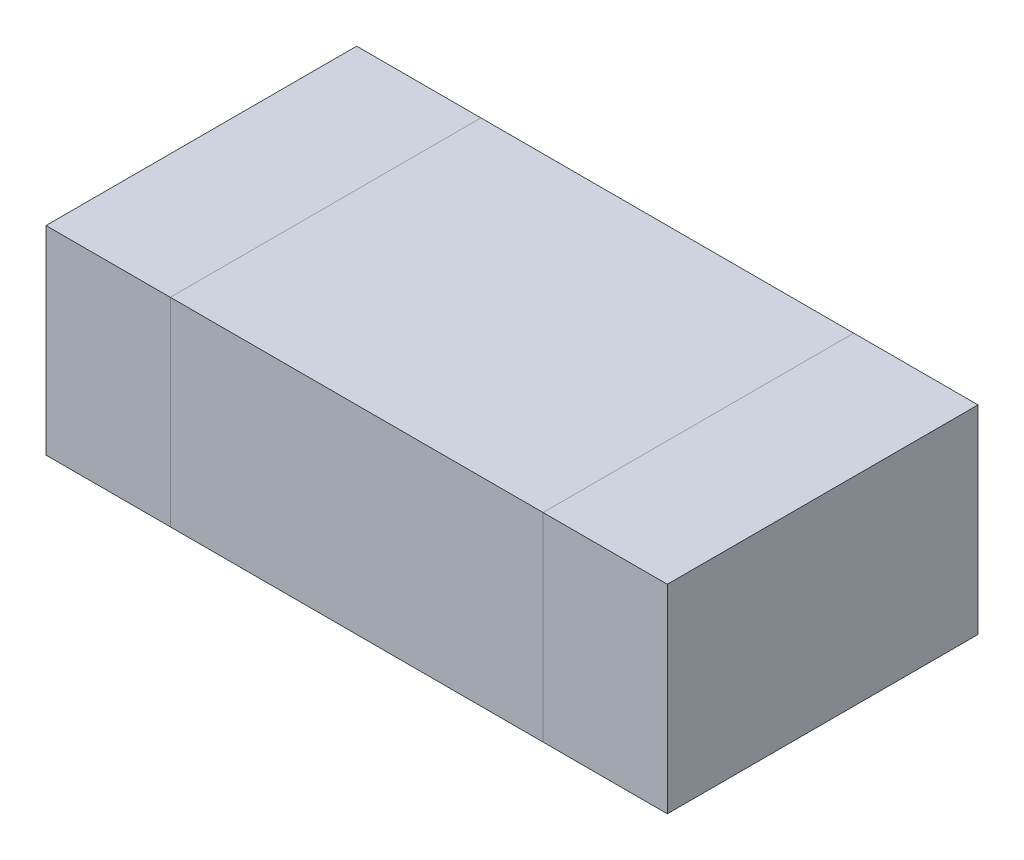
ISO-10303-21;
HEADER;
FILE_DESCRIPTION(('STEP AP214'),'2;1');
FILE_NAME('part.step','',(''),(''),'','','');
FILE_SCHEMA(('AUTOMOTIVE_DESIGN { 1 0 10303 214 1 1 1 1 }'));
ENDSEC;
DATA;
#1=APPLICATION_CONTEXT('core data for automotive mechanical design processes');
#2=APPLICATION_PROTOCOL_DEFINITION('international standard','automotive_design',2000,#1);
#3=PRODUCT_CONTEXT('',#1,'mechanical');
#4=PRODUCT('Part','Part','',(#3));
#5=PRODUCT_RELATED_PRODUCT_CATEGORY('part','',(#4));
#6=PRODUCT_DEFINITION_FORMATION('','',#4);
#7=PRODUCT_DEFINITION_CONTEXT('part definition',#1,'design');
#8=PRODUCT_DEFINITION('design','',#6,#7);
#9=PRODUCT_DEFINITION_SHAPE('','',#8);
#10=(LENGTH_UNIT() NAMED_UNIT(*) SI_UNIT(.MILLI.,.METRE.));
#11=(NAMED_UNIT(*) PLANE_ANGLE_UNIT() SI_UNIT($,.RADIAN.));
#12=(NAMED_UNIT(*) SI_UNIT($,.STERADIAN.) SOLID_ANGLE_UNIT());
#13=UNCERTAINTY_MEASURE_WITH_UNIT(LENGTH_MEASURE(1.E-05),#10,'distance_accuracy_value','');
#14=(GEOMETRIC_REPRESENTATION_CONTEXT(3) GLOBAL_UNCERTAINTY_ASSIGNED_CONTEXT((#13)) GLOBAL_UNIT_ASSIGNED_CONTEXT((#10,
#11,#12)) REPRESENTATION_CONTEXT('',''));
#15=CARTESIAN_POINT('',(0.,0.,0.));
#16=DIRECTION('',(0.,0.,1.));
#17=DIRECTION('',(1.,0.,0.));
#18=AXIS2_PLACEMENT_3D('',#15,#16,#17);
#19=CARTESIAN_POINT('',(-0.5,0.32,0.));
#20=DIRECTION('',(1.,0.,0.));
#21=DIRECTION('',(0.,0.,-1.));
#22=AXIS2_PLACEMENT_3D('',#19,#20,#21);
#23=PLANE('',#22);
#24=DIRECTION('',(0.,1.,0.));
#25=VECTOR('',#24,1.);
#26=CARTESIAN_POINT('',(-0.5,0.32,0.25));
#27=LINE('',#26,#25);
#28=CARTESIAN_POINT('',(-0.5,0.32,0.25));
#29=VERTEX_POINT('',#28);
#30=CARTESIAN_POINT('',(-0.5,0.,0.25));
#31=VERTEX_POINT('',#30);
#32=EDGE_CURVE('P0_E80',#29,#31,#27,.F.);
#33=ORIENTED_EDGE('',*,*,#32,.F.);
#34=DIRECTION('',(0.,0.,1.));
#35=VECTOR('',#34,1.);
#36=CARTESIAN_POINT('',(-0.5,0.32,0.));
#37=LINE('',#36,#35);
#38=CARTESIAN_POINT('',(-0.5,0.32,-0.25));
#39=VERTEX_POINT('',#38);
#40=EDGE_CURVE('P0_E60',#39,#29,#37,.T.);
#41=ORIENTED_EDGE('',*,*,#40,.F.);
#42=DIRECTION('',(0.,1.,0.));
#43=VECTOR('',#42,1.);
#44=CARTESIAN_POINT('',(-0.5,0.32,-0.25));
#45=LINE('',#44,#43);
#46=CARTESIAN_POINT('',(-0.5,0.,-0.25));
#47=VERTEX_POINT('',#46);
#48=EDGE_CURVE('P0_E54',#39,#47,#45,.F.);
#49=ORIENTED_EDGE('',*,*,#48,.T.);
#50=DIRECTION('',(0.,0.,1.));
#51=VECTOR('',#50,1.);
#52=CARTESIAN_POINT('',(-0.5,0.,0.));
#53=LINE('',#52,#51);
#54=EDGE_CURVE('P0_E19',#47,#31,#53,.T.);
#55=ORIENTED_EDGE('',*,*,#54,.T.);
#56=EDGE_LOOP('',(#33,#41,#49,#55));
#57=FACE_BOUND('',#56,.T.);
#58=ADVANCED_FACE('P0_F16',(#57),#23,.F.);
#59=CARTESIAN_POINT('',(0.,0.,0.));
#60=DIRECTION('',(0.,1.,0.));
#61=DIRECTION('',(0.,0.,1.));
#62=AXIS2_PLACEMENT_3D('',#59,#60,#61);
#63=PLANE('',#62);
#64=DIRECTION('',(0.,0.,-1.));
#65=VECTOR('',#64,1.);
#66=CARTESIAN_POINT('',(-0.3,0.,0.));
#67=LINE('',#66,#65);
#68=CARTESIAN_POINT('',(-0.3,0.,0.25));
#69=VERTEX_POINT('',#68);
#70=CARTESIAN_POINT('',(-0.3,0.,-0.25));
#71=VERTEX_POINT('',#70);
#72=EDGE_CURVE('P0_E82',#69,#71,#67,.T.);
#73=ORIENTED_EDGE('',*,*,#72,.F.);
#74=DIRECTION('',(1.,0.,0.));
#75=VECTOR('',#74,1.);
#76=CARTESIAN_POINT('',(0.,0.,0.25));
#77=LINE('',#76,#75);
#78=EDGE_CURVE('P0_E67',#31,#69,#77,.T.);
#79=ORIENTED_EDGE('',*,*,#78,.F.);
#80=ORIENTED_EDGE('',*,*,#54,.F.);
#81=DIRECTION('',(1.,0.,0.));
#82=VECTOR('',#81,1.);
#83=CARTESIAN_POINT('',(0.,0.,-0.25));
#84=LINE('',#83,#82);
#85=EDGE_CURVE('P0_E62',#47,#71,#84,.T.);
#86=ORIENTED_EDGE('',*,*,#85,.T.);
#87=EDGE_LOOP('',(#73,#79,#80,#86));
#88=FACE_BOUND('',#87,.T.);
#89=ADVANCED_FACE('P0_F64',(#88),#63,.F.);
#90=CARTESIAN_POINT('',(0.,0.32,-0.25));
#91=DIRECTION('',(0.,0.,1.));
#92=DIRECTION('',(1.,0.,0.));
#93=AXIS2_PLACEMENT_3D('',#90,#91,#92);
#94=PLANE('',#93);
#95=ORIENTED_EDGE('',*,*,#48,.F.);
#96=DIRECTION('',(1.,0.,0.));
#97=VECTOR('',#96,1.);
#98=CARTESIAN_POINT('',(0.,0.32,-0.25));
#99=LINE('',#98,#97);
#100=CARTESIAN_POINT('',(-0.3,0.32,-0.25));
#101=VERTEX_POINT('',#100);
#102=EDGE_CURVE('P0_E73',#101,#39,#99,.F.);
#103=ORIENTED_EDGE('',*,*,#102,.F.);
#104=DIRECTION('',(0.,1.,0.));
#105=VECTOR('',#104,1.);
#106=CARTESIAN_POINT('',(-0.3,0.32,-0.25));
#107=LINE('',#106,#105);
#108=EDGE_CURVE('P0_E71',#71,#101,#107,.T.);
#109=ORIENTED_EDGE('',*,*,#108,.F.);
#110=ORIENTED_EDGE('',*,*,#85,.F.);
#111=EDGE_LOOP('',(#95,#103,#109,#110));
#112=FACE_BOUND('',#111,.T.);
#113=ADVANCED_FACE('P0_F69',(#112),#94,.F.);
#114=CARTESIAN_POINT('',(0.,0.32,0.));
#115=DIRECTION('',(0.,1.,0.));
#116=DIRECTION('',(0.,0.,1.));
#117=AXIS2_PLACEMENT_3D('',#114,#115,#116);
#118=PLANE('',#117);
#119=DIRECTION('',(1.,0.,0.));
#120=VECTOR('',#119,1.);
#121=CARTESIAN_POINT('',(0.,0.32,0.25));
#122=LINE('',#121,#120);
#123=CARTESIAN_POINT('',(-0.3,0.32,0.25));
#124=VERTEX_POINT('',#123);
#125=EDGE_CURVE('P0_E34',#124,#29,#122,.F.);
#126=ORIENTED_EDGE('',*,*,#125,.F.);
#127=DIRECTION('',(0.,0.,-1.));
#128=VECTOR('',#127,1.);
#129=CARTESIAN_POINT('',(-0.3,0.32,0.));
#130=LINE('',#129,#128);
#131=EDGE_CURVE('P0_E25',#101,#124,#130,.F.);
#132=ORIENTED_EDGE('',*,*,#131,.F.);
#133=ORIENTED_EDGE('',*,*,#102,.T.);
#134=ORIENTED_EDGE('',*,*,#40,.T.);
#135=EDGE_LOOP('',(#126,#132,#133,#134));
#136=FACE_BOUND('',#135,.T.);
#137=ADVANCED_FACE('P0_F88',(#136),#118,.T.);
#138=CARTESIAN_POINT('',(0.,0.32,0.25));
#139=DIRECTION('',(0.,0.,1.));
#140=DIRECTION('',(1.,0.,0.));
#141=AXIS2_PLACEMENT_3D('',#138,#139,#140);
#142=PLANE('',#141);
#143=ORIENTED_EDGE('',*,*,#125,.T.);
#144=ORIENTED_EDGE('',*,*,#32,.T.);
#145=ORIENTED_EDGE('',*,*,#78,.T.);
#146=DIRECTION('',(0.,1.,0.));
#147=VECTOR('',#146,1.);
#148=CARTESIAN_POINT('',(-0.3,0.32,0.25));
#149=LINE('',#148,#147);
#150=EDGE_CURVE('P0_E11',#124,#69,#149,.F.);
#151=ORIENTED_EDGE('',*,*,#150,.F.);
#152=EDGE_LOOP('',(#143,#144,#145,#151));
#153=FACE_BOUND('',#152,.T.);
#154=ADVANCED_FACE('P0_F90',(#153),#142,.T.);
#155=CARTESIAN_POINT('',(-0.3,0.32,0.));
#156=DIRECTION('',(1.,0.,0.));
#157=DIRECTION('',(0.,0.,-1.));
#158=AXIS2_PLACEMENT_3D('',#155,#156,#157);
#159=PLANE('',#158);
#160=ORIENTED_EDGE('',*,*,#131,.T.);
#161=ORIENTED_EDGE('',*,*,#150,.T.);
#162=ORIENTED_EDGE('',*,*,#72,.T.);
#163=ORIENTED_EDGE('',*,*,#108,.T.);
#164=EDGE_LOOP('',(#160,#161,#162,#163));
#165=FACE_BOUND('',#164,.T.);
#166=ADVANCED_FACE('P0_F87',(#165),#159,.T.);
#167=CLOSED_SHELL('',(#58,#89,#113,#137,#154,#166));
#168=MANIFOLD_SOLID_BREP('P0_B1',#167);
#169=CARTESIAN_POINT('',(0.,0.,0.));
#170=DIRECTION('',(0.,1.,0.));
#171=DIRECTION('',(0.,0.,1.));
#172=AXIS2_PLACEMENT_3D('',#169,#170,#171);
#173=PLANE('',#172);
#174=DIRECTION('',(0.,0.,-1.));
#175=VECTOR('',#174,1.);
#176=CARTESIAN_POINT('',(-0.3,0.,0.));
#177=LINE('',#176,#175);
#178=CARTESIAN_POINT('',(-0.3,0.,0.25));
#179=VERTEX_POINT('',#178);
#180=CARTESIAN_POINT('',(-0.3,0.,-0.25));
#181=VERTEX_POINT('',#180);
#182=EDGE_CURVE('P1_E80',#179,#181,#177,.T.);
#183=ORIENTED_EDGE('',*,*,#182,.T.);
#184=DIRECTION('',(-1.,0.,0.));
#185=VECTOR('',#184,1.);
#186=CARTESIAN_POINT('',(0.,0.,-0.25));
#187=LINE('',#186,#185);
#188=CARTESIAN_POINT('',(0.3,0.,-0.25));
#189=VERTEX_POINT('',#188);
#190=EDGE_CURVE('P1_E54',#189,#181,#187,.T.);
#191=ORIENTED_EDGE('',*,*,#190,.F.);
#192=DIRECTION('',(0.,0.,-1.));
#193=VECTOR('',#192,1.);
#194=CARTESIAN_POINT('',(0.3,0.,0.));
#195=LINE('',#194,#193);
#196=CARTESIAN_POINT('',(0.3,0.,0.25));
#197=VERTEX_POINT('',#196);
#198=EDGE_CURVE('P1_E56',#197,#189,#195,.T.);
#199=ORIENTED_EDGE('',*,*,#198,.F.);
#200=DIRECTION('',(-1.,0.,0.));
#201=VECTOR('',#200,1.);
#202=CARTESIAN_POINT('',(0.,0.,0.25));
#203=LINE('',#202,#201);
#204=EDGE_CURVE('P1_E19',#197,#179,#203,.T.);
#205=ORIENTED_EDGE('',*,*,#204,.T.);
#206=EDGE_LOOP('',(#183,#191,#199,#205));
#207=FACE_BOUND('',#206,.T.);
#208=ADVANCED_FACE('P1_F16',(#207),#173,.F.);
#209=CARTESIAN_POINT('',(0.,0.32,0.25));
#210=DIRECTION('',(0.,0.,-1.));
#211=DIRECTION('',(-1.,0.,0.));
#212=AXIS2_PLACEMENT_3D('',#209,#210,#211);
#213=PLANE('',#212);
#214=DIRECTION('',(0.,1.,0.));
#215=VECTOR('',#214,1.);
#216=CARTESIAN_POINT('',(0.3,0.32,0.25));
#217=LINE('',#216,#215);
#218=CARTESIAN_POINT('',(0.3,0.32,0.25));
#219=VERTEX_POINT('',#218);
#220=EDGE_CURVE('P1_E62',#219,#197,#217,.F.);
#221=ORIENTED_EDGE('',*,*,#220,.F.);
#222=DIRECTION('',(1.,0.,0.));
#223=VECTOR('',#222,1.);
#224=CARTESIAN_POINT('',(0.,0.32,0.25));
#225=LINE('',#224,#223);
#226=CARTESIAN_POINT('',(-0.3,0.32,0.25));
#227=VERTEX_POINT('',#226);
#228=EDGE_CURVE('P1_E82',#227,#219,#225,.T.);
#229=ORIENTED_EDGE('',*,*,#228,.F.);
#230=DIRECTION('',(0.,1.,0.));
#231=VECTOR('',#230,1.);
#232=CARTESIAN_POINT('',(-0.3,0.32,0.25));
#233=LINE('',#232,#231);
#234=EDGE_CURVE('P1_E67',#227,#179,#233,.F.);
#235=ORIENTED_EDGE('',*,*,#234,.T.);
#236=ORIENTED_EDGE('',*,*,#204,.F.);
#237=EDGE_LOOP('',(#221,#229,#235,#236));
#238=FACE_BOUND('',#237,.T.);
#239=ADVANCED_FACE('P1_F64',(#238),#213,.F.);
#240=CARTESIAN_POINT('',(0.3,0.32,0.));
#241=DIRECTION('',(1.,0.,0.));
#242=DIRECTION('',(0.,0.,-1.));
#243=AXIS2_PLACEMENT_3D('',#240,#241,#242);
#244=PLANE('',#243);
#245=DIRECTION('',(0.,0.,1.));
#246=VECTOR('',#245,1.);
#247=CARTESIAN_POINT('',(0.3,0.32,0.));
#248=LINE('',#247,#246);
#249=CARTESIAN_POINT('',(0.3,0.32,-0.25));
#250=VERTEX_POINT('',#249);
#251=EDGE_CURVE('P1_E71',#219,#250,#248,.F.);
#252=ORIENTED_EDGE('',*,*,#251,.F.);
#253=ORIENTED_EDGE('',*,*,#220,.T.);
#254=ORIENTED_EDGE('',*,*,#198,.T.);
#255=DIRECTION('',(0.,1.,0.));
#256=VECTOR('',#255,1.);
#257=CARTESIAN_POINT('',(0.3,0.32,-0.25));
#258=LINE('',#257,#256);
#259=EDGE_CURVE('P1_E74',#250,#189,#258,.F.);
#260=ORIENTED_EDGE('',*,*,#259,.F.);
#261=EDGE_LOOP('',(#252,#253,#254,#260));
#262=FACE_BOUND('',#261,.T.);
#263=ADVANCED_FACE('P1_F69',(#262),#244,.T.);
#264=CARTESIAN_POINT('',(0.,0.32,-0.25));
#265=DIRECTION('',(0.,0.,-1.));
#266=DIRECTION('',(-1.,0.,0.));
#267=AXIS2_PLACEMENT_3D('',#264,#265,#266);
#268=PLANE('',#267);
#269=DIRECTION('',(1.,0.,0.));
#270=VECTOR('',#269,1.);
#271=CARTESIAN_POINT('',(0.,0.32,-0.25));
#272=LINE('',#271,#270);
#273=CARTESIAN_POINT('',(-0.3,0.32,-0.25));
#274=VERTEX_POINT('',#273);
#275=EDGE_CURVE('P1_E25',#250,#274,#272,.F.);
#276=ORIENTED_EDGE('',*,*,#275,.F.);
#277=ORIENTED_EDGE('',*,*,#259,.T.);
#278=ORIENTED_EDGE('',*,*,#190,.T.);
#279=DIRECTION('',(0.,1.,0.));
#280=VECTOR('',#279,1.);
#281=CARTESIAN_POINT('',(-0.3,0.32,-0.25));
#282=LINE('',#281,#280);
#283=EDGE_CURVE('P1_E34',#181,#274,#282,.T.);
#284=ORIENTED_EDGE('',*,*,#283,.T.);
#285=EDGE_LOOP('',(#276,#277,#278,#284));
#286=FACE_BOUND('',#285,.T.);
#287=ADVANCED_FACE('P1_F88',(#286),#268,.T.);
#288=CARTESIAN_POINT('',(-0.3,0.32,0.));
#289=DIRECTION('',(1.,0.,0.));
#290=DIRECTION('',(0.,0.,-1.));
#291=AXIS2_PLACEMENT_3D('',#288,#289,#290);
#292=PLANE('',#291);
#293=ORIENTED_EDGE('',*,*,#234,.F.);
#294=DIRECTION('',(0.,0.,1.));
#295=VECTOR('',#294,1.);
#296=CARTESIAN_POINT('',(-0.3,0.32,0.));
#297=LINE('',#296,#295);
#298=EDGE_CURVE('P1_E11',#274,#227,#297,.T.);
#299=ORIENTED_EDGE('',*,*,#298,.F.);
#300=ORIENTED_EDGE('',*,*,#283,.F.);
#301=ORIENTED_EDGE('',*,*,#182,.F.);
#302=EDGE_LOOP('',(#293,#299,#300,#301));
#303=FACE_BOUND('',#302,.T.);
#304=ADVANCED_FACE('P1_F90',(#303),#292,.F.);
#305=CARTESIAN_POINT('',(0.,0.32,0.));
#306=DIRECTION('',(0.,1.,0.));
#307=DIRECTION('',(0.,0.,1.));
#308=AXIS2_PLACEMENT_3D('',#305,#306,#307);
#309=PLANE('',#308);
#310=ORIENTED_EDGE('',*,*,#275,.T.);
#311=ORIENTED_EDGE('',*,*,#298,.T.);
#312=ORIENTED_EDGE('',*,*,#228,.T.);
#313=ORIENTED_EDGE('',*,*,#251,.T.);
#314=EDGE_LOOP('',(#310,#311,#312,#313));
#315=FACE_BOUND('',#314,.T.);
#316=ADVANCED_FACE('P1_F87',(#315),#309,.T.);
#317=CLOSED_SHELL('',(#208,#239,#263,#287,#304,#316));
#318=MANIFOLD_SOLID_BREP('P1_B1',#317);
#319=CARTESIAN_POINT('',(0.3,0.32,0.));
#320=DIRECTION('',(1.,0.,0.));
#321=DIRECTION('',(0.,0.,-1.));
#322=AXIS2_PLACEMENT_3D('',#319,#320,#321);
#323=PLANE('',#322);
#324=DIRECTION('',(0.,1.,0.));
#325=VECTOR('',#324,1.);
#326=CARTESIAN_POINT('',(0.3,0.32,0.25));
#327=LINE('',#326,#325);
#328=CARTESIAN_POINT('',(0.3,0.,0.25));
#329=VERTEX_POINT('',#328);
#330=CARTESIAN_POINT('',(0.3,0.32,0.25));
#331=VERTEX_POINT('',#330);
#332=EDGE_CURVE('P2_E78',#329,#331,#327,.T.);
#333=ORIENTED_EDGE('',*,*,#332,.T.);
#334=DIRECTION('',(0.,0.,1.));
#335=VECTOR('',#334,1.);
#336=CARTESIAN_POINT('',(0.3,0.32,0.));
#337=LINE('',#336,#335);
#338=CARTESIAN_POINT('',(0.3,0.32,-0.25));
#339=VERTEX_POINT('',#338);
#340=EDGE_CURVE('P2_E67',#339,#331,#337,.T.);
#341=ORIENTED_EDGE('',*,*,#340,.F.);
#342=DIRECTION('',(0.,1.,0.));
#343=VECTOR('',#342,1.);
#344=CARTESIAN_POINT('',(0.3,0.32,-0.25));
#345=LINE('',#344,#343);
#346=CARTESIAN_POINT('',(0.3,0.,-0.25));
#347=VERTEX_POINT('',#346);
#348=EDGE_CURVE('P2_E55',#347,#339,#345,.T.);
#349=ORIENTED_EDGE('',*,*,#348,.F.);
#350=DIRECTION('',(0.,0.,1.));
#351=VECTOR('',#350,1.);
#352=CARTESIAN_POINT('',(0.3,0.,0.));
#353=LINE('',#352,#351);
#354=EDGE_CURVE('P2_E19',#347,#329,#353,.T.);
#355=ORIENTED_EDGE('',*,*,#354,.T.);
#356=EDGE_LOOP('',(#333,#341,#349,#355));
#357=FACE_BOUND('',#356,.T.);
#358=ADVANCED_FACE('P2_F16',(#357),#323,.F.);
#359=CARTESIAN_POINT('',(0.,0.,0.));
#360=DIRECTION('',(0.,1.,0.));
#361=DIRECTION('',(0.,0.,1.));
#362=AXIS2_PLACEMENT_3D('',#359,#360,#361);
#363=PLANE('',#362);
#364=DIRECTION('',(-1.,0.,0.));
#365=VECTOR('',#364,1.);
#366=CARTESIAN_POINT('',(0.,0.,0.25));
#367=LINE('',#366,#365);
#368=CARTESIAN_POINT('',(0.5,0.,0.25));
#369=VERTEX_POINT('',#368);
#370=EDGE_CURVE('P2_E64',#369,#329,#367,.T.);
#371=ORIENTED_EDGE('',*,*,#370,.T.);
#372=ORIENTED_EDGE('',*,*,#354,.F.);
#373=DIRECTION('',(-1.,0.,0.));
#374=VECTOR('',#373,1.);
#375=CARTESIAN_POINT('',(0.,0.,-0.25));
#376=LINE('',#375,#374);
#377=CARTESIAN_POINT('',(0.5,0.,-0.25));
#378=VERTEX_POINT('',#377);
#379=EDGE_CURVE('P2_E61',#378,#347,#376,.T.);
#380=ORIENTED_EDGE('',*,*,#379,.F.);
#381=DIRECTION('',(0.,0.,-1.));
#382=VECTOR('',#381,1.);
#383=CARTESIAN_POINT('',(0.5,0.,0.));
#384=LINE('',#383,#382);
#385=EDGE_CURVE('P2_E82',#369,#378,#384,.T.);
#386=ORIENTED_EDGE('',*,*,#385,.F.);
#387=EDGE_LOOP('',(#371,#372,#380,#386));
#388=FACE_BOUND('',#387,.T.);
#389=ADVANCED_FACE('P2_F60',(#388),#363,.F.);
#390=CARTESIAN_POINT('',(0.,0.32,-0.25));
#391=DIRECTION('',(0.,0.,-1.));
#392=DIRECTION('',(-1.,0.,0.));
#393=AXIS2_PLACEMENT_3D('',#390,#391,#392);
#394=PLANE('',#393);
#395=DIRECTION('',(1.,0.,0.));
#396=VECTOR('',#395,1.);
#397=CARTESIAN_POINT('',(0.,0.32,-0.25));
#398=LINE('',#397,#396);
#399=CARTESIAN_POINT('',(0.5,0.32,-0.25));
#400=VERTEX_POINT('',#399);
#401=EDGE_CURVE('P2_E69',#400,#339,#398,.F.);
#402=ORIENTED_EDGE('',*,*,#401,.F.);
#403=DIRECTION('',(0.,1.,0.));
#404=VECTOR('',#403,1.);
#405=CARTESIAN_POINT('',(0.5,0.32,-0.25));
#406=LINE('',#405,#404);
#407=EDGE_CURVE('P2_E73',#378,#400,#406,.T.);
#408=ORIENTED_EDGE('',*,*,#407,.F.);
#409=ORIENTED_EDGE('',*,*,#379,.T.);
#410=ORIENTED_EDGE('',*,*,#348,.T.);
#411=EDGE_LOOP('',(#402,#408,#409,#410));
#412=FACE_BOUND('',#411,.T.);
#413=ADVANCED_FACE('P2_F71',(#412),#394,.T.);
#414=CARTESIAN_POINT('',(0.,0.32,0.));
#415=DIRECTION('',(0.,1.,0.));
#416=DIRECTION('',(0.,0.,1.));
#417=AXIS2_PLACEMENT_3D('',#414,#415,#416);
#418=PLANE('',#417);
#419=ORIENTED_EDGE('',*,*,#340,.T.);
#420=DIRECTION('',(-1.,0.,0.));
#421=VECTOR('',#420,1.);
#422=CARTESIAN_POINT('',(0.,0.32,0.25));
#423=LINE('',#422,#421);
#424=CARTESIAN_POINT('',(0.5,0.32,0.25));
#425=VERTEX_POINT('',#424);
#426=EDGE_CURVE('P2_E34',#331,#425,#423,.F.);
#427=ORIENTED_EDGE('',*,*,#426,.T.);
#428=DIRECTION('',(0.,0.,-1.));
#429=VECTOR('',#428,1.);
#430=CARTESIAN_POINT('',(0.5,0.32,0.));
#431=LINE('',#430,#429);
#432=EDGE_CURVE('P2_E25',#400,#425,#431,.F.);
#433=ORIENTED_EDGE('',*,*,#432,.F.);
#434=ORIENTED_EDGE('',*,*,#401,.T.);
#435=EDGE_LOOP('',(#419,#427,#433,#434));
#436=FACE_BOUND('',#435,.T.);
#437=ADVANCED_FACE('P2_F88',(#436),#418,.T.);
#438=CARTESIAN_POINT('',(0.,0.32,0.25));
#439=DIRECTION('',(0.,0.,-1.));
#440=DIRECTION('',(-1.,0.,0.));
#441=AXIS2_PLACEMENT_3D('',#438,#439,#440);
#442=PLANE('',#441);
#443=DIRECTION('',(0.,1.,0.));
#444=VECTOR('',#443,1.);
#445=CARTESIAN_POINT('',(0.5,0.32,0.25));
#446=LINE('',#445,#444);
#447=EDGE_CURVE('P2_E11',#425,#369,#446,.F.);
#448=ORIENTED_EDGE('',*,*,#447,.F.);
#449=ORIENTED_EDGE('',*,*,#426,.F.);
#450=ORIENTED_EDGE('',*,*,#332,.F.);
#451=ORIENTED_EDGE('',*,*,#370,.F.);
#452=EDGE_LOOP('',(#448,#449,#450,#451));
#453=FACE_BOUND('',#452,.T.);
#454=ADVANCED_FACE('P2_F90',(#453),#442,.F.);
#455=CARTESIAN_POINT('',(0.5,0.32,0.));
#456=DIRECTION('',(1.,0.,0.));
#457=DIRECTION('',(0.,0.,-1.));
#458=AXIS2_PLACEMENT_3D('',#455,#456,#457);
#459=PLANE('',#458);
#460=ORIENTED_EDGE('',*,*,#432,.T.);
#461=ORIENTED_EDGE('',*,*,#447,.T.);
#462=ORIENTED_EDGE('',*,*,#385,.T.);
#463=ORIENTED_EDGE('',*,*,#407,.T.);
#464=EDGE_LOOP('',(#460,#461,#462,#463));
#465=FACE_BOUND('',#464,.T.);
#466=ADVANCED_FACE('P2_F87',(#465),#459,.T.);
#467=CLOSED_SHELL('',(#358,#389,#413,#437,#454,#466));
#468=MANIFOLD_SOLID_BREP('P2_B1',#467);
#469=ADVANCED_BREP_SHAPE_REPRESENTATION('',(#18,#168,#318,#468),#14);
#470=SHAPE_DEFINITION_REPRESENTATION(#9,#469);
ENDSEC;
END-ISO-10303-21;
